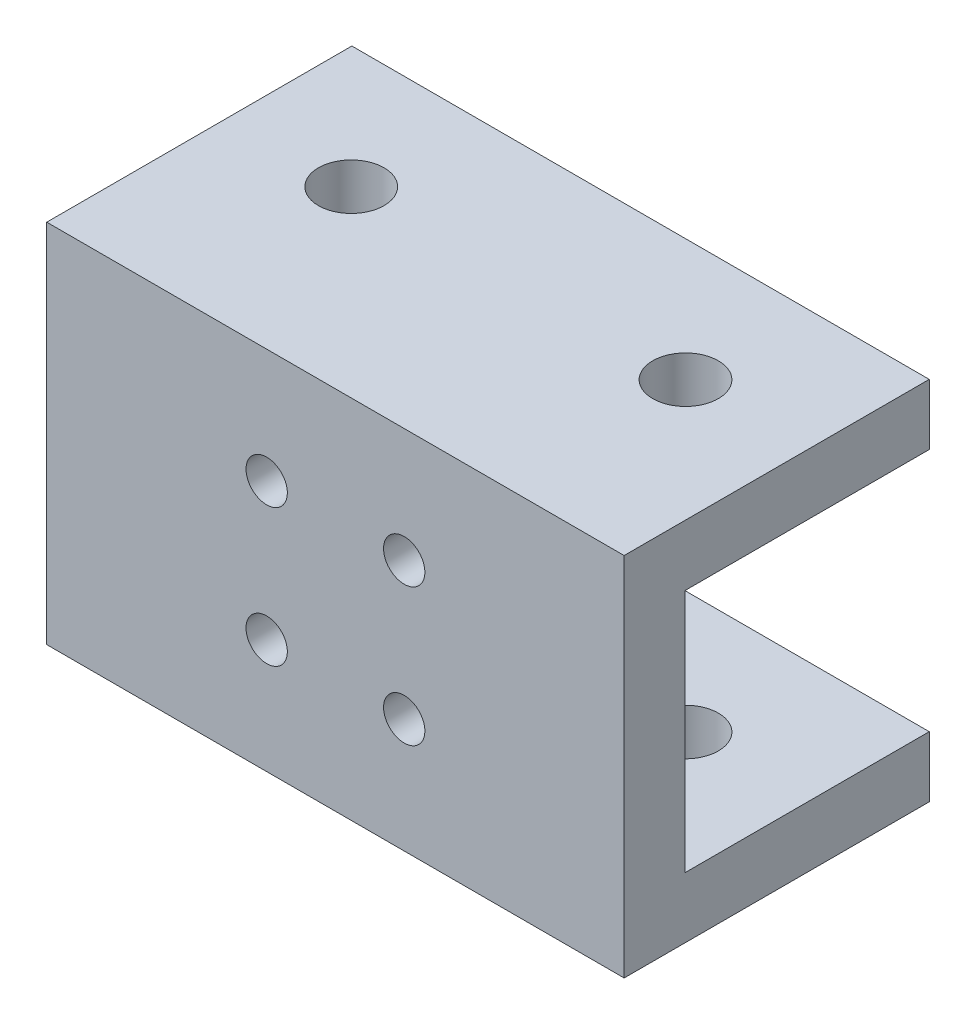
ISO-10303-21;
HEADER;
FILE_DESCRIPTION(('STEP AP214'),'2;1');
FILE_NAME('part.step','',(''),(''),'','','');
FILE_SCHEMA(('AUTOMOTIVE_DESIGN { 1 0 10303 214 1 1 1 1 }'));
ENDSEC;
DATA;
#1=APPLICATION_CONTEXT('core data for automotive mechanical design processes');
#2=APPLICATION_PROTOCOL_DEFINITION('international standard','automotive_design',2000,#1);
#3=PRODUCT_CONTEXT('',#1,'mechanical');
#4=PRODUCT('Part','Part','',(#3));
#5=PRODUCT_RELATED_PRODUCT_CATEGORY('part','',(#4));
#6=PRODUCT_DEFINITION_FORMATION('','',#4);
#7=PRODUCT_DEFINITION_CONTEXT('part definition',#1,'design');
#8=PRODUCT_DEFINITION('design','',#6,#7);
#9=PRODUCT_DEFINITION_SHAPE('','',#8);
#10=(LENGTH_UNIT() NAMED_UNIT(*) SI_UNIT(.MILLI.,.METRE.));
#11=(NAMED_UNIT(*) PLANE_ANGLE_UNIT() SI_UNIT($,.RADIAN.));
#12=(NAMED_UNIT(*) SI_UNIT($,.STERADIAN.) SOLID_ANGLE_UNIT());
#13=UNCERTAINTY_MEASURE_WITH_UNIT(LENGTH_MEASURE(1.E-05),#10,'distance_accuracy_value','');
#14=(GEOMETRIC_REPRESENTATION_CONTEXT(3) GLOBAL_UNCERTAINTY_ASSIGNED_CONTEXT((#13)) GLOBAL_UNIT_ASSIGNED_CONTEXT((#10,
#11,#12)) REPRESENTATION_CONTEXT('',''));
#15=CARTESIAN_POINT('',(0.,0.,0.));
#16=DIRECTION('',(0.,0.,1.));
#17=DIRECTION('',(1.,0.,0.));
#18=AXIS2_PLACEMENT_3D('',#15,#16,#17);
#19=CARTESIAN_POINT('',(47.5,10.05,10.05));
#20=DIRECTION('',(0.,0.,1.));
#21=DIRECTION('',(0.,-1.,0.));
#22=AXIS2_PLACEMENT_3D('',#19,#20,#21);
#23=PLANE('',#22);
#24=CARTESIAN_POINT('',(29.4068542494924,5.65685424949241,10.05));
#25=DIRECTION('',(0.,0.,-1.));
#26=DIRECTION('',(0.,1.,0.));
#27=AXIS2_PLACEMENT_3D('',#24,#25,#26);
#28=CIRCLE('',#27,3.15);
#29=CARTESIAN_POINT('',(29.4068542494924,8.80685424949241,10.05));
#30=VERTEX_POINT('',#29);
#31=EDGE_CURVE('E183',#30,#30,#28,.T.);
#32=ORIENTED_EDGE('',*,*,#31,.F.);
#33=EDGE_LOOP('',(#32));
#34=FACE_BOUND('',#33,.T.);
#35=CARTESIAN_POINT('',(18.0931457505076,5.65685424949235,10.05));
#36=DIRECTION('',(0.,0.,-1.));
#37=DIRECTION('',(0.,1.,0.));
#38=AXIS2_PLACEMENT_3D('',#35,#36,#37);
#39=CIRCLE('',#38,3.15);
#40=CARTESIAN_POINT('',(18.0931457505076,8.80685424949235,10.05));
#41=VERTEX_POINT('',#40);
#42=EDGE_CURVE('E192',#41,#41,#39,.T.);
#43=ORIENTED_EDGE('',*,*,#42,.F.);
#44=EDGE_LOOP('',(#43));
#45=FACE_BOUND('',#44,.T.);
#46=CARTESIAN_POINT('',(18.0931457505076,-5.65685424949241,10.05));
#47=DIRECTION('',(0.,0.,-1.));
#48=DIRECTION('',(0.,1.,0.));
#49=AXIS2_PLACEMENT_3D('',#46,#47,#48);
#50=CIRCLE('',#49,3.15);
#51=CARTESIAN_POINT('',(18.0931457505076,-2.50685424949241,10.05));
#52=VERTEX_POINT('',#51);
#53=EDGE_CURVE('E201',#52,#52,#50,.T.);
#54=ORIENTED_EDGE('',*,*,#53,.F.);
#55=EDGE_LOOP('',(#54));
#56=FACE_BOUND('',#55,.T.);
#57=CARTESIAN_POINT('',(29.4068542494924,-5.65685424949235,10.05));
#58=DIRECTION('',(0.,0.,-1.));
#59=DIRECTION('',(0.,1.,0.));
#60=AXIS2_PLACEMENT_3D('',#57,#58,#59);
#61=CIRCLE('',#60,3.15);
#62=CARTESIAN_POINT('',(29.4068542494924,-2.50685424949235,10.05));
#63=VERTEX_POINT('',#62);
#64=EDGE_CURVE('E210',#63,#63,#61,.T.);
#65=ORIENTED_EDGE('',*,*,#64,.F.);
#66=EDGE_LOOP('',(#65));
#67=FACE_BOUND('',#66,.T.);
#68=DIRECTION('',(0.,1.,0.));
#69=VECTOR('',#68,1.);
#70=CARTESIAN_POINT('',(0.,10.05,10.05));
#71=LINE('',#70,#69);
#72=CARTESIAN_POINT('',(0.,-10.05,10.05));
#73=VERTEX_POINT('',#72);
#74=CARTESIAN_POINT('',(0.,10.05,10.05));
#75=VERTEX_POINT('',#74);
#76=EDGE_CURVE('E132',#73,#75,#71,.T.);
#77=ORIENTED_EDGE('',*,*,#76,.T.);
#78=DIRECTION('',(-1.,0.,0.));
#79=VECTOR('',#78,1.);
#80=CARTESIAN_POINT('',(47.5,10.05,10.05));
#81=LINE('',#80,#79);
#82=CARTESIAN_POINT('',(47.5,10.05,10.05));
#83=VERTEX_POINT('',#82);
#84=EDGE_CURVE('E11',#83,#75,#81,.T.);
#85=ORIENTED_EDGE('',*,*,#84,.F.);
#86=DIRECTION('',(0.,1.,0.));
#87=VECTOR('',#86,1.);
#88=CARTESIAN_POINT('',(47.5,10.05,10.05));
#89=LINE('',#88,#87);
#90=CARTESIAN_POINT('',(47.5,-10.05,10.05));
#91=VERTEX_POINT('',#90);
#92=EDGE_CURVE('E147',#91,#83,#89,.T.);
#93=ORIENTED_EDGE('',*,*,#92,.F.);
#94=DIRECTION('',(-1.,0.,0.));
#95=VECTOR('',#94,1.);
#96=CARTESIAN_POINT('',(47.5,-10.05,10.05));
#97=LINE('',#96,#95);
#98=EDGE_CURVE('E128',#91,#73,#97,.T.);
#99=ORIENTED_EDGE('',*,*,#98,.T.);
#100=EDGE_LOOP('',(#77,#85,#93,#99));
#101=FACE_BOUND('',#100,.T.);
#102=ADVANCED_FACE('F34',(#34,#45,#56,#67,#101),#23,.F.);
#103=CARTESIAN_POINT('',(47.5,10.05,-10.05));
#104=DIRECTION('',(0.,1.,0.));
#105=DIRECTION('',(0.,0.,1.));
#106=AXIS2_PLACEMENT_3D('',#103,#104,#105);
#107=PLANE('',#106);
#108=CARTESIAN_POINT('',(10.,10.05,0.));
#109=DIRECTION('',(0.,1.,0.));
#110=DIRECTION('',(0.,0.,1.));
#111=AXIS2_PLACEMENT_3D('',#108,#109,#110);
#112=CIRCLE('',#111,2.7);
#113=CARTESIAN_POINT('',(10.,10.05,2.7));
#114=VERTEX_POINT('',#113);
#115=EDGE_CURVE('E180',#114,#114,#112,.T.);
#116=ORIENTED_EDGE('',*,*,#115,.T.);
#117=EDGE_LOOP('',(#116));
#118=FACE_BOUND('',#117,.T.);
#119=CARTESIAN_POINT('',(37.5,10.05,0.));
#120=DIRECTION('',(0.,1.,0.));
#121=DIRECTION('',(0.,0.,1.));
#122=AXIS2_PLACEMENT_3D('',#119,#120,#121);
#123=CIRCLE('',#122,2.7);
#124=CARTESIAN_POINT('',(37.5,10.05,2.70000000000001));
#125=VERTEX_POINT('',#124);
#126=EDGE_CURVE('E160',#125,#125,#123,.T.);
#127=ORIENTED_EDGE('',*,*,#126,.T.);
#128=EDGE_LOOP('',(#127));
#129=FACE_BOUND('',#128,.T.);
#130=DIRECTION('',(0.,0.,-1.));
#131=VECTOR('',#130,1.);
#132=CARTESIAN_POINT('',(0.,10.05,-10.05));
#133=LINE('',#132,#131);
#134=CARTESIAN_POINT('',(0.,10.05,-10.05));
#135=VERTEX_POINT('',#134);
#136=EDGE_CURVE('E135',#75,#135,#133,.T.);
#137=ORIENTED_EDGE('',*,*,#136,.T.);
#138=DIRECTION('',(-1.,0.,0.));
#139=VECTOR('',#138,1.);
#140=CARTESIAN_POINT('',(47.5,10.05,-10.05));
#141=LINE('',#140,#139);
#142=CARTESIAN_POINT('',(47.5,10.05,-10.05));
#143=VERTEX_POINT('',#142);
#144=EDGE_CURVE('E43',#143,#135,#141,.T.);
#145=ORIENTED_EDGE('',*,*,#144,.F.);
#146=DIRECTION('',(0.,0.,-1.));
#147=VECTOR('',#146,1.);
#148=CARTESIAN_POINT('',(47.5,10.05,-10.05));
#149=LINE('',#148,#147);
#150=EDGE_CURVE('E95',#83,#143,#149,.T.);
#151=ORIENTED_EDGE('',*,*,#150,.F.);
#152=ORIENTED_EDGE('',*,*,#84,.T.);
#153=EDGE_LOOP('',(#137,#145,#151,#152));
#154=FACE_BOUND('',#153,.T.);
#155=ADVANCED_FACE('F253',(#118,#129,#154),#107,.F.);
#156=CARTESIAN_POINT('',(47.5,15.05,-10.05));
#157=DIRECTION('',(0.,0.,1.));
#158=DIRECTION('',(1.,0.,0.));
#159=AXIS2_PLACEMENT_3D('',#156,#157,#158);
#160=PLANE('',#159);
#161=DIRECTION('',(0.,1.,0.));
#162=VECTOR('',#161,1.);
#163=CARTESIAN_POINT('',(0.,15.05,-10.05));
#164=LINE('',#163,#162);
#165=CARTESIAN_POINT('',(0.,15.05,-10.05));
#166=VERTEX_POINT('',#165);
#167=EDGE_CURVE('E138',#135,#166,#164,.T.);
#168=ORIENTED_EDGE('',*,*,#167,.T.);
#169=DIRECTION('',(-1.,0.,0.));
#170=VECTOR('',#169,1.);
#171=CARTESIAN_POINT('',(47.5,15.05,-10.05));
#172=LINE('',#171,#170);
#173=CARTESIAN_POINT('',(47.5,15.05,-10.05));
#174=VERTEX_POINT('',#173);
#175=EDGE_CURVE('E154',#174,#166,#172,.T.);
#176=ORIENTED_EDGE('',*,*,#175,.F.);
#177=DIRECTION('',(0.,1.,0.));
#178=VECTOR('',#177,1.);
#179=CARTESIAN_POINT('',(47.5,15.05,-10.05));
#180=LINE('',#179,#178);
#181=EDGE_CURVE('E220',#143,#174,#180,.T.);
#182=ORIENTED_EDGE('',*,*,#181,.F.);
#183=ORIENTED_EDGE('',*,*,#144,.T.);
#184=EDGE_LOOP('',(#168,#176,#182,#183));
#185=FACE_BOUND('',#184,.T.);
#186=ADVANCED_FACE('F258',(#185),#160,.F.);
#187=CARTESIAN_POINT('',(47.5,15.05,15.05));
#188=DIRECTION('',(0.,-1.,0.));
#189=DIRECTION('',(0.,0.,-1.));
#190=AXIS2_PLACEMENT_3D('',#187,#188,#189);
#191=PLANE('',#190);
#192=CARTESIAN_POINT('',(10.,15.05,0.));
#193=DIRECTION('',(0.,1.,0.));
#194=DIRECTION('',(0.,0.,1.));
#195=AXIS2_PLACEMENT_3D('',#192,#193,#194);
#196=CIRCLE('',#195,2.7);
#197=CARTESIAN_POINT('',(10.,15.05,2.7));
#198=VERTEX_POINT('',#197);
#199=EDGE_CURVE('E167',#198,#198,#196,.T.);
#200=ORIENTED_EDGE('',*,*,#199,.F.);
#201=EDGE_LOOP('',(#200));
#202=FACE_BOUND('',#201,.T.);
#203=CARTESIAN_POINT('',(37.5,15.05,0.));
#204=DIRECTION('',(0.,1.,0.));
#205=DIRECTION('',(0.,0.,1.));
#206=AXIS2_PLACEMENT_3D('',#203,#204,#205);
#207=CIRCLE('',#206,2.7);
#208=CARTESIAN_POINT('',(37.5,15.05,2.70000000000001));
#209=VERTEX_POINT('',#208);
#210=EDGE_CURVE('E177',#209,#209,#207,.T.);
#211=ORIENTED_EDGE('',*,*,#210,.F.);
#212=EDGE_LOOP('',(#211));
#213=FACE_BOUND('',#212,.T.);
#214=DIRECTION('',(0.,0.,1.));
#215=VECTOR('',#214,1.);
#216=CARTESIAN_POINT('',(0.,15.05,15.05));
#217=LINE('',#216,#215);
#218=CARTESIAN_POINT('',(0.,15.05,15.05));
#219=VERTEX_POINT('',#218);
#220=EDGE_CURVE('E140',#166,#219,#217,.T.);
#221=ORIENTED_EDGE('',*,*,#220,.T.);
#222=DIRECTION('',(-1.,0.,0.));
#223=VECTOR('',#222,1.);
#224=CARTESIAN_POINT('',(47.5,15.05,15.05));
#225=LINE('',#224,#223);
#226=CARTESIAN_POINT('',(47.5,15.05,15.05));
#227=VERTEX_POINT('',#226);
#228=EDGE_CURVE('E151',#227,#219,#225,.T.);
#229=ORIENTED_EDGE('',*,*,#228,.F.);
#230=DIRECTION('',(0.,0.,1.));
#231=VECTOR('',#230,1.);
#232=CARTESIAN_POINT('',(47.5,15.05,15.05));
#233=LINE('',#232,#231);
#234=EDGE_CURVE('E222',#174,#227,#233,.T.);
#235=ORIENTED_EDGE('',*,*,#234,.F.);
#236=ORIENTED_EDGE('',*,*,#175,.T.);
#237=EDGE_LOOP('',(#221,#229,#235,#236));
#238=FACE_BOUND('',#237,.T.);
#239=ADVANCED_FACE('F228',(#202,#213,#238),#191,.F.);
#240=CARTESIAN_POINT('',(47.5,-15.05,15.05));
#241=DIRECTION('',(0.,0.,-1.));
#242=DIRECTION('',(-1.,0.,0.));
#243=AXIS2_PLACEMENT_3D('',#240,#241,#242);
#244=PLANE('',#243);
#245=CARTESIAN_POINT('',(29.4068542494924,5.65685424949241,15.05));
#246=DIRECTION('',(0.,0.,-1.));
#247=DIRECTION('',(0.,1.,0.));
#248=AXIS2_PLACEMENT_3D('',#245,#246,#247);
#249=CIRCLE('',#248,1.7);
#250=CARTESIAN_POINT('',(29.4068542494924,7.35685424949241,15.05));
#251=VERTEX_POINT('',#250);
#252=EDGE_CURVE('E189',#251,#251,#249,.T.);
#253=ORIENTED_EDGE('',*,*,#252,.T.);
#254=EDGE_LOOP('',(#253));
#255=FACE_BOUND('',#254,.T.);
#256=CARTESIAN_POINT('',(18.0931457505076,5.65685424949235,15.05));
#257=DIRECTION('',(0.,0.,-1.));
#258=DIRECTION('',(0.,1.,0.));
#259=AXIS2_PLACEMENT_3D('',#256,#257,#258);
#260=CIRCLE('',#259,1.7);
#261=CARTESIAN_POINT('',(18.0931457505076,7.35685424949235,15.05));
#262=VERTEX_POINT('',#261);
#263=EDGE_CURVE('E198',#262,#262,#260,.T.);
#264=ORIENTED_EDGE('',*,*,#263,.T.);
#265=EDGE_LOOP('',(#264));
#266=FACE_BOUND('',#265,.T.);
#267=CARTESIAN_POINT('',(18.0931457505076,-5.65685424949241,15.05));
#268=DIRECTION('',(0.,0.,-1.));
#269=DIRECTION('',(0.,1.,0.));
#270=AXIS2_PLACEMENT_3D('',#267,#268,#269);
#271=CIRCLE('',#270,1.7);
#272=CARTESIAN_POINT('',(18.0931457505076,-3.95685424949241,15.05));
#273=VERTEX_POINT('',#272);
#274=EDGE_CURVE('E207',#273,#273,#271,.T.);
#275=ORIENTED_EDGE('',*,*,#274,.T.);
#276=EDGE_LOOP('',(#275));
#277=FACE_BOUND('',#276,.T.);
#278=CARTESIAN_POINT('',(29.4068542494924,-5.65685424949235,15.05));
#279=DIRECTION('',(0.,0.,-1.));
#280=DIRECTION('',(0.,1.,0.));
#281=AXIS2_PLACEMENT_3D('',#278,#279,#280);
#282=CIRCLE('',#281,1.7);
#283=CARTESIAN_POINT('',(29.4068542494924,-3.95685424949235,15.05));
#284=VERTEX_POINT('',#283);
#285=EDGE_CURVE('E136',#284,#284,#282,.T.);
#286=ORIENTED_EDGE('',*,*,#285,.T.);
#287=EDGE_LOOP('',(#286));
#288=FACE_BOUND('',#287,.T.);
#289=DIRECTION('',(0.,-1.,0.));
#290=VECTOR('',#289,1.);
#291=CARTESIAN_POINT('',(0.,-15.05,15.05));
#292=LINE('',#291,#290);
#293=CARTESIAN_POINT('',(0.,-15.05,15.05));
#294=VERTEX_POINT('',#293);
#295=EDGE_CURVE('E142',#219,#294,#292,.T.);
#296=ORIENTED_EDGE('',*,*,#295,.T.);
#297=DIRECTION('',(-1.,0.,0.));
#298=VECTOR('',#297,1.);
#299=CARTESIAN_POINT('',(47.5,-15.05,15.05));
#300=LINE('',#299,#298);
#301=CARTESIAN_POINT('',(47.5,-15.05,15.05));
#302=VERTEX_POINT('',#301);
#303=EDGE_CURVE('E123',#302,#294,#300,.T.);
#304=ORIENTED_EDGE('',*,*,#303,.F.);
#305=DIRECTION('',(0.,-1.,0.));
#306=VECTOR('',#305,1.);
#307=CARTESIAN_POINT('',(47.5,-15.05,15.05));
#308=LINE('',#307,#306);
#309=EDGE_CURVE('E114',#227,#302,#308,.T.);
#310=ORIENTED_EDGE('',*,*,#309,.F.);
#311=ORIENTED_EDGE('',*,*,#228,.T.);
#312=EDGE_LOOP('',(#296,#304,#310,#311));
#313=FACE_BOUND('',#312,.T.);
#314=ADVANCED_FACE('F232',(#255,#266,#277,#288,#313),#244,.F.);
#315=CARTESIAN_POINT('',(47.5,-15.05,-10.05));
#316=DIRECTION('',(0.,1.,0.));
#317=DIRECTION('',(0.,0.,1.));
#318=AXIS2_PLACEMENT_3D('',#315,#316,#317);
#319=PLANE('',#318);
#320=CARTESIAN_POINT('',(10.,-15.05,0.));
#321=DIRECTION('',(0.,1.,0.));
#322=DIRECTION('',(0.,0.,1.));
#323=AXIS2_PLACEMENT_3D('',#320,#321,#322);
#324=CIRCLE('',#323,2.7);
#325=CARTESIAN_POINT('',(10.,-15.05,2.7));
#326=VERTEX_POINT('',#325);
#327=EDGE_CURVE('E161',#326,#326,#324,.T.);
#328=ORIENTED_EDGE('',*,*,#327,.T.);
#329=EDGE_LOOP('',(#328));
#330=FACE_BOUND('',#329,.T.);
#331=CARTESIAN_POINT('',(37.5,-15.05,0.));
#332=DIRECTION('',(0.,1.,0.));
#333=DIRECTION('',(0.,0.,1.));
#334=AXIS2_PLACEMENT_3D('',#331,#332,#333);
#335=CIRCLE('',#334,2.7);
#336=CARTESIAN_POINT('',(37.5,-15.05,2.7));
#337=VERTEX_POINT('',#336);
#338=EDGE_CURVE('E172',#337,#337,#335,.T.);
#339=ORIENTED_EDGE('',*,*,#338,.T.);
#340=EDGE_LOOP('',(#339));
#341=FACE_BOUND('',#340,.T.);
#342=DIRECTION('',(0.,0.,-1.));
#343=VECTOR('',#342,1.);
#344=CARTESIAN_POINT('',(0.,-15.05,-10.05));
#345=LINE('',#344,#343);
#346=CARTESIAN_POINT('',(0.,-15.05,-10.05));
#347=VERTEX_POINT('',#346);
#348=EDGE_CURVE('E122',#294,#347,#345,.T.);
#349=ORIENTED_EDGE('',*,*,#348,.T.);
#350=DIRECTION('',(-1.,0.,0.));
#351=VECTOR('',#350,1.);
#352=CARTESIAN_POINT('',(47.5,-15.05,-10.05));
#353=LINE('',#352,#351);
#354=CARTESIAN_POINT('',(47.5,-15.05,-10.05));
#355=VERTEX_POINT('',#354);
#356=EDGE_CURVE('E119',#355,#347,#353,.T.);
#357=ORIENTED_EDGE('',*,*,#356,.F.);
#358=DIRECTION('',(0.,0.,-1.));
#359=VECTOR('',#358,1.);
#360=CARTESIAN_POINT('',(47.5,-15.05,-10.05));
#361=LINE('',#360,#359);
#362=EDGE_CURVE('E108',#302,#355,#361,.T.);
#363=ORIENTED_EDGE('',*,*,#362,.F.);
#364=ORIENTED_EDGE('',*,*,#303,.T.);
#365=EDGE_LOOP('',(#349,#357,#363,#364));
#366=FACE_BOUND('',#365,.T.);
#367=ADVANCED_FACE('F120',(#330,#341,#366),#319,.F.);
#368=CARTESIAN_POINT('',(47.5,-10.05,-10.05));
#369=DIRECTION('',(0.,0.,1.));
#370=DIRECTION('',(0.,-1.,0.));
#371=AXIS2_PLACEMENT_3D('',#368,#369,#370);
#372=PLANE('',#371);
#373=DIRECTION('',(0.,1.,0.));
#374=VECTOR('',#373,1.);
#375=CARTESIAN_POINT('',(0.,-10.05,-10.05));
#376=LINE('',#375,#374);
#377=CARTESIAN_POINT('',(0.,-10.05,-10.05));
#378=VERTEX_POINT('',#377);
#379=EDGE_CURVE('E81',#347,#378,#376,.T.);
#380=ORIENTED_EDGE('',*,*,#379,.T.);
#381=DIRECTION('',(-1.,0.,0.));
#382=VECTOR('',#381,1.);
#383=CARTESIAN_POINT('',(47.5,-10.05,-10.05));
#384=LINE('',#383,#382);
#385=CARTESIAN_POINT('',(47.5,-10.05,-10.05));
#386=VERTEX_POINT('',#385);
#387=EDGE_CURVE('E124',#386,#378,#384,.T.);
#388=ORIENTED_EDGE('',*,*,#387,.F.);
#389=DIRECTION('',(0.,1.,0.));
#390=VECTOR('',#389,1.);
#391=CARTESIAN_POINT('',(47.5,-10.05,-10.05));
#392=LINE('',#391,#390);
#393=EDGE_CURVE('E112',#355,#386,#392,.T.);
#394=ORIENTED_EDGE('',*,*,#393,.F.);
#395=ORIENTED_EDGE('',*,*,#356,.T.);
#396=EDGE_LOOP('',(#380,#388,#394,#395));
#397=FACE_BOUND('',#396,.T.);
#398=ADVANCED_FACE('F126',(#397),#372,.F.);
#399=CARTESIAN_POINT('',(47.5,-10.05,10.05));
#400=DIRECTION('',(0.,-1.,0.));
#401=DIRECTION('',(0.,0.,-1.));
#402=AXIS2_PLACEMENT_3D('',#399,#400,#401);
#403=PLANE('',#402);
#404=CARTESIAN_POINT('',(10.,-10.05,0.));
#405=DIRECTION('',(0.,-1.,0.));
#406=DIRECTION('',(0.,0.,-1.));
#407=AXIS2_PLACEMENT_3D('',#404,#405,#406);
#408=CIRCLE('',#407,2.7);
#409=CARTESIAN_POINT('',(10.,-10.05,-2.7));
#410=VERTEX_POINT('',#409);
#411=EDGE_CURVE('E37',#410,#410,#408,.T.);
#412=ORIENTED_EDGE('',*,*,#411,.T.);
#413=EDGE_LOOP('',(#412));
#414=FACE_BOUND('',#413,.T.);
#415=CARTESIAN_POINT('',(37.5,-10.05,0.));
#416=DIRECTION('',(0.,-1.,0.));
#417=DIRECTION('',(0.,0.,-1.));
#418=AXIS2_PLACEMENT_3D('',#415,#416,#417);
#419=CIRCLE('',#418,2.7);
#420=CARTESIAN_POINT('',(37.5,-10.05,-2.70000000000001));
#421=VERTEX_POINT('',#420);
#422=EDGE_CURVE('E158',#421,#421,#419,.T.);
#423=ORIENTED_EDGE('',*,*,#422,.T.);
#424=EDGE_LOOP('',(#423));
#425=FACE_BOUND('',#424,.T.);
#426=DIRECTION('',(0.,0.,1.));
#427=VECTOR('',#426,1.);
#428=CARTESIAN_POINT('',(0.,-10.05,10.05));
#429=LINE('',#428,#427);
#430=EDGE_CURVE('E87',#378,#73,#429,.T.);
#431=ORIENTED_EDGE('',*,*,#430,.T.);
#432=ORIENTED_EDGE('',*,*,#98,.F.);
#433=DIRECTION('',(0.,0.,1.));
#434=VECTOR('',#433,1.);
#435=CARTESIAN_POINT('',(47.5,-10.05,10.05));
#436=LINE('',#435,#434);
#437=EDGE_CURVE('E52',#386,#91,#436,.T.);
#438=ORIENTED_EDGE('',*,*,#437,.F.);
#439=ORIENTED_EDGE('',*,*,#387,.T.);
#440=EDGE_LOOP('',(#431,#432,#438,#439));
#441=FACE_BOUND('',#440,.T.);
#442=ADVANCED_FACE('F240',(#414,#425,#441),#403,.F.);
#443=CARTESIAN_POINT('',(47.5,0.,0.));
#444=DIRECTION('',(1.,0.,0.));
#445=DIRECTION('',(0.,0.,-1.));
#446=AXIS2_PLACEMENT_3D('',#443,#444,#445);
#447=PLANE('',#446);
#448=ORIENTED_EDGE('',*,*,#92,.T.);
#449=ORIENTED_EDGE('',*,*,#150,.T.);
#450=ORIENTED_EDGE('',*,*,#181,.T.);
#451=ORIENTED_EDGE('',*,*,#234,.T.);
#452=ORIENTED_EDGE('',*,*,#309,.T.);
#453=ORIENTED_EDGE('',*,*,#362,.T.);
#454=ORIENTED_EDGE('',*,*,#393,.T.);
#455=ORIENTED_EDGE('',*,*,#437,.T.);
#456=EDGE_LOOP('',(#448,#449,#450,#451,#452,#453,#454,#455));
#457=FACE_BOUND('',#456,.T.);
#458=ADVANCED_FACE('F110',(#457),#447,.T.);
#459=CARTESIAN_POINT('',(0.,0.,0.));
#460=DIRECTION('',(1.,0.,0.));
#461=DIRECTION('',(0.,0.,-1.));
#462=AXIS2_PLACEMENT_3D('',#459,#460,#461);
#463=PLANE('',#462);
#464=ORIENTED_EDGE('',*,*,#76,.F.);
#465=ORIENTED_EDGE('',*,*,#430,.F.);
#466=ORIENTED_EDGE('',*,*,#379,.F.);
#467=ORIENTED_EDGE('',*,*,#348,.F.);
#468=ORIENTED_EDGE('',*,*,#295,.F.);
#469=ORIENTED_EDGE('',*,*,#220,.F.);
#470=ORIENTED_EDGE('',*,*,#167,.F.);
#471=ORIENTED_EDGE('',*,*,#136,.F.);
#472=EDGE_LOOP('',(#464,#465,#466,#467,#468,#469,#470,#471));
#473=FACE_BOUND('',#472,.T.);
#474=ADVANCED_FACE('F235',(#473),#463,.F.);
#475=CARTESIAN_POINT('',(29.4068542494924,-5.65685424949235,10.05));
#476=DIRECTION('',(0.,0.,-1.));
#477=DIRECTION('',(0.,1.,0.));
#478=AXIS2_PLACEMENT_3D('',#475,#476,#477);
#479=CYLINDRICAL_SURFACE('',#478,1.7);
#480=ORIENTED_EDGE('',*,*,#285,.F.);
#481=EDGE_LOOP('',(#480));
#482=FACE_BOUND('',#481,.T.);
#483=CARTESIAN_POINT('',(29.4068542494924,-5.65685424949235,11.5));
#484=DIRECTION('',(0.,0.,-1.));
#485=DIRECTION('',(0.,1.,0.));
#486=AXIS2_PLACEMENT_3D('',#483,#484,#485);
#487=CIRCLE('',#486,1.7);
#488=CARTESIAN_POINT('',(29.4068542494924,-3.95685424949235,11.5));
#489=VERTEX_POINT('',#488);
#490=EDGE_CURVE('E213',#489,#489,#487,.T.);
#491=ORIENTED_EDGE('',*,*,#490,.T.);
#492=EDGE_LOOP('',(#491));
#493=FACE_BOUND('',#492,.T.);
#494=ADVANCED_FACE('F271',(#482,#493),#479,.F.);
#495=CARTESIAN_POINT('',(29.4068542494924,-5.65685424949235,10.05));
#496=DIRECTION('',(0.,0.,-1.));
#497=DIRECTION('',(0.,1.,0.));
#498=AXIS2_PLACEMENT_3D('',#495,#496,#497);
#499=CONICAL_SURFACE('',#498,3.15,0.785398163397448);
#500=ORIENTED_EDGE('',*,*,#490,.F.);
#501=EDGE_LOOP('',(#500));
#502=FACE_BOUND('',#501,.T.);
#503=ORIENTED_EDGE('',*,*,#64,.T.);
#504=EDGE_LOOP('',(#503));
#505=FACE_BOUND('',#504,.T.);
#506=ADVANCED_FACE('F268',(#502,#505),#499,.F.);
#507=CARTESIAN_POINT('',(18.0931457505076,-5.65685424949241,10.05));
#508=DIRECTION('',(0.,0.,-1.));
#509=DIRECTION('',(0.,1.,0.));
#510=AXIS2_PLACEMENT_3D('',#507,#508,#509);
#511=CYLINDRICAL_SURFACE('',#510,1.7);
#512=ORIENTED_EDGE('',*,*,#274,.F.);
#513=EDGE_LOOP('',(#512));
#514=FACE_BOUND('',#513,.T.);
#515=CARTESIAN_POINT('',(18.0931457505076,-5.65685424949241,11.5));
#516=DIRECTION('',(0.,0.,-1.));
#517=DIRECTION('',(0.,1.,0.));
#518=AXIS2_PLACEMENT_3D('',#515,#516,#517);
#519=CIRCLE('',#518,1.7);
#520=CARTESIAN_POINT('',(18.0931457505076,-3.95685424949241,11.5));
#521=VERTEX_POINT('',#520);
#522=EDGE_CURVE('E204',#521,#521,#519,.T.);
#523=ORIENTED_EDGE('',*,*,#522,.T.);
#524=EDGE_LOOP('',(#523));
#525=FACE_BOUND('',#524,.T.);
#526=ADVANCED_FACE('F270',(#514,#525),#511,.F.);
#527=CARTESIAN_POINT('',(18.0931457505076,-5.65685424949241,10.05));
#528=DIRECTION('',(0.,0.,-1.));
#529=DIRECTION('',(0.,1.,0.));
#530=AXIS2_PLACEMENT_3D('',#527,#528,#529);
#531=CONICAL_SURFACE('',#530,3.15,0.785398163397448);
#532=ORIENTED_EDGE('',*,*,#522,.F.);
#533=EDGE_LOOP('',(#532));
#534=FACE_BOUND('',#533,.T.);
#535=ORIENTED_EDGE('',*,*,#53,.T.);
#536=EDGE_LOOP('',(#535));
#537=FACE_BOUND('',#536,.T.);
#538=ADVANCED_FACE('F278',(#534,#537),#531,.F.);
#539=CARTESIAN_POINT('',(18.0931457505076,5.65685424949235,10.05));
#540=DIRECTION('',(0.,0.,-1.));
#541=DIRECTION('',(0.,1.,0.));
#542=AXIS2_PLACEMENT_3D('',#539,#540,#541);
#543=CYLINDRICAL_SURFACE('',#542,1.7);
#544=ORIENTED_EDGE('',*,*,#263,.F.);
#545=EDGE_LOOP('',(#544));
#546=FACE_BOUND('',#545,.T.);
#547=CARTESIAN_POINT('',(18.0931457505076,5.65685424949235,11.5));
#548=DIRECTION('',(0.,0.,-1.));
#549=DIRECTION('',(0.,1.,0.));
#550=AXIS2_PLACEMENT_3D('',#547,#548,#549);
#551=CIRCLE('',#550,1.7);
#552=CARTESIAN_POINT('',(18.0931457505076,7.35685424949235,11.5));
#553=VERTEX_POINT('',#552);
#554=EDGE_CURVE('E195',#553,#553,#551,.T.);
#555=ORIENTED_EDGE('',*,*,#554,.T.);
#556=EDGE_LOOP('',(#555));
#557=FACE_BOUND('',#556,.T.);
#558=ADVANCED_FACE('F317',(#546,#557),#543,.F.);
#559=CARTESIAN_POINT('',(18.0931457505076,5.65685424949235,10.05));
#560=DIRECTION('',(0.,0.,-1.));
#561=DIRECTION('',(0.,1.,0.));
#562=AXIS2_PLACEMENT_3D('',#559,#560,#561);
#563=CONICAL_SURFACE('',#562,3.15,0.785398163397448);
#564=ORIENTED_EDGE('',*,*,#554,.F.);
#565=EDGE_LOOP('',(#564));
#566=FACE_BOUND('',#565,.T.);
#567=ORIENTED_EDGE('',*,*,#42,.T.);
#568=EDGE_LOOP('',(#567));
#569=FACE_BOUND('',#568,.T.);
#570=ADVANCED_FACE('F326',(#566,#569),#563,.F.);
#571=CARTESIAN_POINT('',(29.4068542494924,5.65685424949241,10.05));
#572=DIRECTION('',(0.,0.,-1.));
#573=DIRECTION('',(0.,1.,0.));
#574=AXIS2_PLACEMENT_3D('',#571,#572,#573);
#575=CYLINDRICAL_SURFACE('',#574,1.7);
#576=ORIENTED_EDGE('',*,*,#252,.F.);
#577=EDGE_LOOP('',(#576));
#578=FACE_BOUND('',#577,.T.);
#579=CARTESIAN_POINT('',(29.4068542494924,5.65685424949241,11.5));
#580=DIRECTION('',(0.,0.,-1.));
#581=DIRECTION('',(0.,1.,0.));
#582=AXIS2_PLACEMENT_3D('',#579,#580,#581);
#583=CIRCLE('',#582,1.7);
#584=CARTESIAN_POINT('',(29.4068542494924,7.35685424949241,11.5));
#585=VERTEX_POINT('',#584);
#586=EDGE_CURVE('E186',#585,#585,#583,.T.);
#587=ORIENTED_EDGE('',*,*,#586,.T.);
#588=EDGE_LOOP('',(#587));
#589=FACE_BOUND('',#588,.T.);
#590=ADVANCED_FACE('F336',(#578,#589),#575,.F.);
#591=CARTESIAN_POINT('',(29.4068542494924,5.65685424949241,10.05));
#592=DIRECTION('',(0.,0.,-1.));
#593=DIRECTION('',(0.,1.,0.));
#594=AXIS2_PLACEMENT_3D('',#591,#592,#593);
#595=CONICAL_SURFACE('',#594,3.15,0.785398163397449);
#596=ORIENTED_EDGE('',*,*,#586,.F.);
#597=EDGE_LOOP('',(#596));
#598=FACE_BOUND('',#597,.T.);
#599=ORIENTED_EDGE('',*,*,#31,.T.);
#600=EDGE_LOOP('',(#599));
#601=FACE_BOUND('',#600,.T.);
#602=ADVANCED_FACE('F346',(#598,#601),#595,.F.);
#603=CARTESIAN_POINT('',(37.5,-15.05,0.));
#604=DIRECTION('',(0.,1.,0.));
#605=DIRECTION('',(0.,0.,1.));
#606=AXIS2_PLACEMENT_3D('',#603,#604,#605);
#607=CYLINDRICAL_SURFACE('',#606,2.7);
#608=ORIENTED_EDGE('',*,*,#338,.F.);
#609=EDGE_LOOP('',(#608));
#610=FACE_BOUND('',#609,.T.);
#611=ORIENTED_EDGE('',*,*,#422,.F.);
#612=EDGE_LOOP('',(#611));
#613=FACE_BOUND('',#612,.T.);
#614=ADVANCED_FACE('F356',(#610,#613),#607,.F.);
#615=CARTESIAN_POINT('',(10.,-15.05,0.));
#616=DIRECTION('',(0.,1.,0.));
#617=DIRECTION('',(0.,0.,1.));
#618=AXIS2_PLACEMENT_3D('',#615,#616,#617);
#619=CYLINDRICAL_SURFACE('',#618,2.7);
#620=ORIENTED_EDGE('',*,*,#327,.F.);
#621=EDGE_LOOP('',(#620));
#622=FACE_BOUND('',#621,.T.);
#623=ORIENTED_EDGE('',*,*,#411,.F.);
#624=EDGE_LOOP('',(#623));
#625=FACE_BOUND('',#624,.T.);
#626=ADVANCED_FACE('F398',(#622,#625),#619,.F.);
#627=ORIENTED_EDGE('',*,*,#210,.T.);
#628=EDGE_LOOP('',(#627));
#629=FACE_BOUND('',#628,.T.);
#630=ORIENTED_EDGE('',*,*,#126,.F.);
#631=EDGE_LOOP('',(#630));
#632=FACE_BOUND('',#631,.T.);
#633=ADVANCED_FACE('F401',(#629,#632),#607,.F.);
#634=ORIENTED_EDGE('',*,*,#199,.T.);
#635=EDGE_LOOP('',(#634));
#636=FACE_BOUND('',#635,.T.);
#637=ORIENTED_EDGE('',*,*,#115,.F.);
#638=EDGE_LOOP('',(#637));
#639=FACE_BOUND('',#638,.T.);
#640=ADVANCED_FACE('F411',(#636,#639),#619,.F.);
#641=CLOSED_SHELL('',(#102,#155,#186,#239,#314,#367,#398,#442,#458,#474,#494,#506,#526,#538,
#558,#570,#590,#602,#614,#626,#633,#640));
#642=MANIFOLD_SOLID_BREP('B2',#641);
#643=ADVANCED_BREP_SHAPE_REPRESENTATION('',(#18,#642),#14);
#644=SHAPE_DEFINITION_REPRESENTATION(#9,#643);
ENDSEC;
END-ISO-10303-21;
